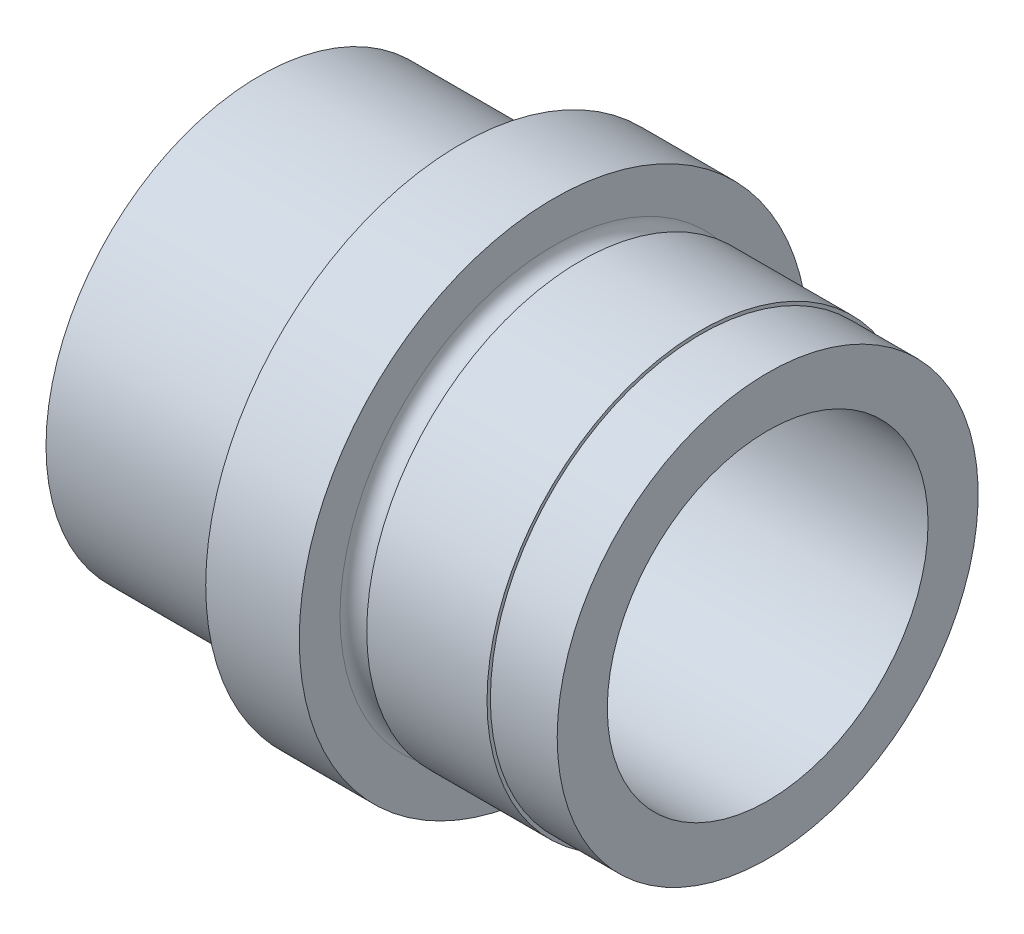
ISO-10303-21;
HEADER;
FILE_DESCRIPTION(('STEP AP214'),'2;1');
FILE_NAME('part.step','',(''),(''),'','','');
FILE_SCHEMA(('AUTOMOTIVE_DESIGN { 1 0 10303 214 1 1 1 1 }'));
ENDSEC;
DATA;
#1=APPLICATION_CONTEXT('core data for automotive mechanical design processes');
#2=APPLICATION_PROTOCOL_DEFINITION('international standard','automotive_design',2000,#1);
#3=PRODUCT_CONTEXT('',#1,'mechanical');
#4=PRODUCT('Part','Part','',(#3));
#5=PRODUCT_RELATED_PRODUCT_CATEGORY('part','',(#4));
#6=PRODUCT_DEFINITION_FORMATION('','',#4);
#7=PRODUCT_DEFINITION_CONTEXT('part definition',#1,'design');
#8=PRODUCT_DEFINITION('design','',#6,#7);
#9=PRODUCT_DEFINITION_SHAPE('','',#8);
#10=(LENGTH_UNIT() NAMED_UNIT(*) SI_UNIT(.MILLI.,.METRE.));
#11=(NAMED_UNIT(*) PLANE_ANGLE_UNIT() SI_UNIT($,.RADIAN.));
#12=(NAMED_UNIT(*) SI_UNIT($,.STERADIAN.) SOLID_ANGLE_UNIT());
#13=UNCERTAINTY_MEASURE_WITH_UNIT(LENGTH_MEASURE(1.E-05),#10,'distance_accuracy_value','');
#14=(GEOMETRIC_REPRESENTATION_CONTEXT(3) GLOBAL_UNCERTAINTY_ASSIGNED_CONTEXT((#13)) GLOBAL_UNIT_ASSIGNED_CONTEXT((#10,
#11,#12)) REPRESENTATION_CONTEXT('',''));
#15=CARTESIAN_POINT('',(0.,0.,0.));
#16=DIRECTION('',(0.,0.,1.));
#17=DIRECTION('',(1.,0.,0.));
#18=AXIS2_PLACEMENT_3D('',#15,#16,#17);
#19=CARTESIAN_POINT('',(-90.6162162162162,0.,0.));
#20=DIRECTION('',(-1.,0.,0.));
#21=DIRECTION('',(0.,0.,1.));
#22=AXIS2_PLACEMENT_3D('',#19,#20,#21);
#23=CYLINDRICAL_SURFACE('',#22,12.25);
#24=CARTESIAN_POINT('',(5.,0.,0.));
#25=DIRECTION('',(-1.,0.,0.));
#26=DIRECTION('',(0.,0.,1.));
#27=AXIS2_PLACEMENT_3D('',#24,#25,#26);
#28=CIRCLE('',#27,12.25);
#29=CARTESIAN_POINT('',(5.,0.,12.25));
#30=VERTEX_POINT('',#29);
#31=EDGE_CURVE('E10',#30,#30,#28,.T.);
#32=ORIENTED_EDGE('',*,*,#31,.F.);
#33=EDGE_LOOP('',(#32));
#34=FACE_BOUND('',#33,.T.);
#35=CARTESIAN_POINT('',(0.,0.,0.));
#36=DIRECTION('',(-1.,0.,0.));
#37=DIRECTION('',(0.,0.,1.));
#38=AXIS2_PLACEMENT_3D('',#35,#36,#37);
#39=CIRCLE('',#38,12.25);
#40=CARTESIAN_POINT('',(0.,0.,12.25));
#41=VERTEX_POINT('',#40);
#42=EDGE_CURVE('E74',#41,#41,#39,.T.);
#43=ORIENTED_EDGE('',*,*,#42,.T.);
#44=EDGE_LOOP('',(#43));
#45=FACE_BOUND('',#44,.T.);
#46=ADVANCED_FACE('F28',(#34,#45),#23,.F.);
#47=CARTESIAN_POINT('',(5.,12.,0.));
#48=DIRECTION('',(1.,0.,0.));
#49=DIRECTION('',(0.,0.,-1.));
#50=AXIS2_PLACEMENT_3D('',#47,#48,#49);
#51=PLANE('',#50);
#52=CARTESIAN_POINT('',(5.,0.,0.));
#53=DIRECTION('',(-1.,0.,0.));
#54=DIRECTION('',(0.,0.,1.));
#55=AXIS2_PLACEMENT_3D('',#52,#53,#54);
#56=CIRCLE('',#55,12.);
#57=CARTESIAN_POINT('',(5.,0.,12.));
#58=VERTEX_POINT('',#57);
#59=EDGE_CURVE('E34',#58,#58,#56,.T.);
#60=ORIENTED_EDGE('',*,*,#59,.F.);
#61=EDGE_LOOP('',(#60));
#62=FACE_BOUND('',#61,.T.);
#63=ORIENTED_EDGE('',*,*,#31,.T.);
#64=EDGE_LOOP('',(#63));
#65=FACE_BOUND('',#64,.T.);
#66=ADVANCED_FACE('F147',(#62,#65),#51,.F.);
#67=CARTESIAN_POINT('',(-90.6162162162162,0.,0.));
#68=DIRECTION('',(-1.,0.,0.));
#69=DIRECTION('',(0.,0.,1.));
#70=AXIS2_PLACEMENT_3D('',#67,#68,#69);
#71=CYLINDRICAL_SURFACE('',#70,12.);
#72=CARTESIAN_POINT('',(38.,0.,0.));
#73=DIRECTION('',(-1.,0.,0.));
#74=DIRECTION('',(0.,0.,1.));
#75=AXIS2_PLACEMENT_3D('',#72,#73,#74);
#76=CIRCLE('',#75,12.);
#77=CARTESIAN_POINT('',(38.,0.,12.));
#78=VERTEX_POINT('',#77);
#79=EDGE_CURVE('E38',#78,#78,#76,.T.);
#80=ORIENTED_EDGE('',*,*,#79,.F.);
#81=EDGE_LOOP('',(#80));
#82=FACE_BOUND('',#81,.T.);
#83=ORIENTED_EDGE('',*,*,#59,.T.);
#84=EDGE_LOOP('',(#83));
#85=FACE_BOUND('',#84,.T.);
#86=ADVANCED_FACE('F142',(#82,#85),#71,.F.);
#87=CARTESIAN_POINT('',(38.,15.75,0.));
#88=DIRECTION('',(-1.,0.,0.));
#89=DIRECTION('',(0.,0.,1.));
#90=AXIS2_PLACEMENT_3D('',#87,#88,#89);
#91=PLANE('',#90);
#92=CARTESIAN_POINT('',(38.,0.,0.));
#93=DIRECTION('',(-1.,0.,0.));
#94=DIRECTION('',(0.,0.,1.));
#95=AXIS2_PLACEMENT_3D('',#92,#93,#94);
#96=CIRCLE('',#95,15.75);
#97=CARTESIAN_POINT('',(38.,0.,15.75));
#98=VERTEX_POINT('',#97);
#99=EDGE_CURVE('E42',#98,#98,#96,.T.);
#100=ORIENTED_EDGE('',*,*,#99,.F.);
#101=EDGE_LOOP('',(#100));
#102=FACE_BOUND('',#101,.T.);
#103=ORIENTED_EDGE('',*,*,#79,.T.);
#104=EDGE_LOOP('',(#103));
#105=FACE_BOUND('',#104,.T.);
#106=ADVANCED_FACE('F136',(#102,#105),#91,.F.);
#107=CARTESIAN_POINT('',(-90.6162162162162,0.,0.));
#108=DIRECTION('',(-1.,0.,0.));
#109=DIRECTION('',(0.,0.,1.));
#110=AXIS2_PLACEMENT_3D('',#107,#108,#109);
#111=CYLINDRICAL_SURFACE('',#110,15.75);
#112=CARTESIAN_POINT('',(33.,0.,0.));
#113=DIRECTION('',(-1.,0.,0.));
#114=DIRECTION('',(0.,0.,1.));
#115=AXIS2_PLACEMENT_3D('',#112,#113,#114);
#116=CIRCLE('',#115,15.75);
#117=CARTESIAN_POINT('',(33.,0.,15.75));
#118=VERTEX_POINT('',#117);
#119=EDGE_CURVE('E47',#118,#118,#116,.T.);
#120=ORIENTED_EDGE('',*,*,#119,.F.);
#121=EDGE_LOOP('',(#120));
#122=FACE_BOUND('',#121,.T.);
#123=ORIENTED_EDGE('',*,*,#99,.T.);
#124=EDGE_LOOP('',(#123));
#125=FACE_BOUND('',#124,.T.);
#126=ADVANCED_FACE('F130',(#122,#125),#111,.T.);
#127=CARTESIAN_POINT('',(33.,16.,0.));
#128=DIRECTION('',(-1.,0.,0.));
#129=DIRECTION('',(0.,0.,1.));
#130=AXIS2_PLACEMENT_3D('',#127,#128,#129);
#131=PLANE('',#130);
#132=CARTESIAN_POINT('',(33.,0.,0.));
#133=DIRECTION('',(-1.,0.,0.));
#134=DIRECTION('',(0.,0.,1.));
#135=AXIS2_PLACEMENT_3D('',#132,#133,#134);
#136=CIRCLE('',#135,16.);
#137=CARTESIAN_POINT('',(33.,0.,16.));
#138=VERTEX_POINT('',#137);
#139=EDGE_CURVE('E50',#138,#138,#136,.T.);
#140=ORIENTED_EDGE('',*,*,#139,.F.);
#141=EDGE_LOOP('',(#140));
#142=FACE_BOUND('',#141,.T.);
#143=ORIENTED_EDGE('',*,*,#119,.T.);
#144=EDGE_LOOP('',(#143));
#145=FACE_BOUND('',#144,.T.);
#146=ADVANCED_FACE('F124',(#142,#145),#131,.F.);
#147=CARTESIAN_POINT('',(-90.6162162162162,0.,0.));
#148=DIRECTION('',(-1.,0.,0.));
#149=DIRECTION('',(0.,0.,1.));
#150=AXIS2_PLACEMENT_3D('',#147,#148,#149);
#151=CYLINDRICAL_SURFACE('',#150,16.);
#152=CARTESIAN_POINT('',(24.,0.,0.));
#153=DIRECTION('',(-1.,0.,0.));
#154=DIRECTION('',(0.,0.,1.));
#155=AXIS2_PLACEMENT_3D('',#152,#153,#154);
#156=CIRCLE('',#155,16.);
#157=CARTESIAN_POINT('',(24.,0.,16.));
#158=VERTEX_POINT('',#157);
#159=EDGE_CURVE('E53',#158,#158,#156,.T.);
#160=ORIENTED_EDGE('',*,*,#159,.F.);
#161=EDGE_LOOP('',(#160));
#162=FACE_BOUND('',#161,.T.);
#163=ORIENTED_EDGE('',*,*,#139,.T.);
#164=EDGE_LOOP('',(#163));
#165=FACE_BOUND('',#164,.T.);
#166=ADVANCED_FACE('F118',(#162,#165),#151,.T.);
#167=CARTESIAN_POINT('',(23.,0.,0.));
#168=DIRECTION('',(-1.,0.,0.));
#169=DIRECTION('',(0.,0.,1.));
#170=AXIS2_PLACEMENT_3D('',#167,#168,#169);
#171=TOROIDAL_SURFACE('',#170,16.,0.999999999999999);
#172=CARTESIAN_POINT('',(22.,0.,0.));
#173=DIRECTION('',(-1.,0.,0.));
#174=DIRECTION('',(0.,0.,1.));
#175=AXIS2_PLACEMENT_3D('',#172,#173,#174);
#176=CIRCLE('',#175,16.);
#177=CARTESIAN_POINT('',(22.,0.,16.));
#178=VERTEX_POINT('',#177);
#179=EDGE_CURVE('E56',#178,#178,#176,.T.);
#180=ORIENTED_EDGE('',*,*,#179,.F.);
#181=EDGE_LOOP('',(#180));
#182=FACE_BOUND('',#181,.T.);
#183=ORIENTED_EDGE('',*,*,#159,.T.);
#184=EDGE_LOOP('',(#183));
#185=FACE_BOUND('',#184,.T.);
#186=ADVANCED_FACE('F112',(#182,#185),#171,.F.);
#187=CARTESIAN_POINT('',(22.,19.05,0.));
#188=DIRECTION('',(-1.,0.,0.));
#189=DIRECTION('',(0.,0.,1.));
#190=AXIS2_PLACEMENT_3D('',#187,#188,#189);
#191=PLANE('',#190);
#192=CARTESIAN_POINT('',(22.,0.,0.));
#193=DIRECTION('',(-1.,0.,0.));
#194=DIRECTION('',(0.,0.,1.));
#195=AXIS2_PLACEMENT_3D('',#192,#193,#194);
#196=CIRCLE('',#195,19.05);
#197=CARTESIAN_POINT('',(22.,0.,19.05));
#198=VERTEX_POINT('',#197);
#199=EDGE_CURVE('E59',#198,#198,#196,.T.);
#200=ORIENTED_EDGE('',*,*,#199,.F.);
#201=EDGE_LOOP('',(#200));
#202=FACE_BOUND('',#201,.T.);
#203=ORIENTED_EDGE('',*,*,#179,.T.);
#204=EDGE_LOOP('',(#203));
#205=FACE_BOUND('',#204,.T.);
#206=ADVANCED_FACE('F106',(#202,#205),#191,.F.);
#207=CARTESIAN_POINT('',(-90.6162162162162,0.,0.));
#208=DIRECTION('',(-1.,0.,0.));
#209=DIRECTION('',(0.,0.,1.));
#210=AXIS2_PLACEMENT_3D('',#207,#208,#209);
#211=CYLINDRICAL_SURFACE('',#210,19.05);
#212=CARTESIAN_POINT('',(15.,0.,0.));
#213=DIRECTION('',(-1.,0.,0.));
#214=DIRECTION('',(0.,0.,1.));
#215=AXIS2_PLACEMENT_3D('',#212,#213,#214);
#216=CIRCLE('',#215,19.05);
#217=CARTESIAN_POINT('',(15.,0.,19.05));
#218=VERTEX_POINT('',#217);
#219=EDGE_CURVE('E62',#218,#218,#216,.T.);
#220=ORIENTED_EDGE('',*,*,#219,.F.);
#221=EDGE_LOOP('',(#220));
#222=FACE_BOUND('',#221,.T.);
#223=ORIENTED_EDGE('',*,*,#199,.T.);
#224=EDGE_LOOP('',(#223));
#225=FACE_BOUND('',#224,.T.);
#226=ADVANCED_FACE('F100',(#222,#225),#211,.T.);
#227=CARTESIAN_POINT('',(15.,16.,0.));
#228=DIRECTION('',(1.,0.,0.));
#229=DIRECTION('',(0.,0.,-1.));
#230=AXIS2_PLACEMENT_3D('',#227,#228,#229);
#231=PLANE('',#230);
#232=CARTESIAN_POINT('',(15.,0.,0.));
#233=DIRECTION('',(-1.,0.,0.));
#234=DIRECTION('',(0.,0.,1.));
#235=AXIS2_PLACEMENT_3D('',#232,#233,#234);
#236=CIRCLE('',#235,16.);
#237=CARTESIAN_POINT('',(15.,0.,16.));
#238=VERTEX_POINT('',#237);
#239=EDGE_CURVE('E65',#238,#238,#236,.T.);
#240=ORIENTED_EDGE('',*,*,#239,.F.);
#241=EDGE_LOOP('',(#240));
#242=FACE_BOUND('',#241,.T.);
#243=ORIENTED_EDGE('',*,*,#219,.T.);
#244=EDGE_LOOP('',(#243));
#245=FACE_BOUND('',#244,.T.);
#246=ADVANCED_FACE('F94',(#242,#245),#231,.F.);
#247=CARTESIAN_POINT('',(14.,0.,0.));
#248=DIRECTION('',(-1.,0.,0.));
#249=DIRECTION('',(0.,0.,1.));
#250=AXIS2_PLACEMENT_3D('',#247,#248,#249);
#251=TOROIDAL_SURFACE('',#250,16.,1.);
#252=CARTESIAN_POINT('',(13.,0.,0.));
#253=DIRECTION('',(-1.,0.,0.));
#254=DIRECTION('',(0.,0.,1.));
#255=AXIS2_PLACEMENT_3D('',#252,#253,#254);
#256=CIRCLE('',#255,16.);
#257=CARTESIAN_POINT('',(13.,0.,16.));
#258=VERTEX_POINT('',#257);
#259=EDGE_CURVE('E68',#258,#258,#256,.T.);
#260=ORIENTED_EDGE('',*,*,#259,.F.);
#261=EDGE_LOOP('',(#260));
#262=FACE_BOUND('',#261,.T.);
#263=ORIENTED_EDGE('',*,*,#239,.T.);
#264=EDGE_LOOP('',(#263));
#265=FACE_BOUND('',#264,.T.);
#266=ADVANCED_FACE('F88',(#262,#265),#251,.F.);
#267=CARTESIAN_POINT('',(-90.6162162162162,0.,0.));
#268=DIRECTION('',(-1.,0.,0.));
#269=DIRECTION('',(0.,0.,1.));
#270=AXIS2_PLACEMENT_3D('',#267,#268,#269);
#271=CYLINDRICAL_SURFACE('',#270,16.);
#272=CARTESIAN_POINT('',(0.,0.,0.));
#273=DIRECTION('',(-1.,0.,0.));
#274=DIRECTION('',(0.,0.,1.));
#275=AXIS2_PLACEMENT_3D('',#272,#273,#274);
#276=CIRCLE('',#275,16.);
#277=CARTESIAN_POINT('',(0.,0.,16.));
#278=VERTEX_POINT('',#277);
#279=EDGE_CURVE('E71',#278,#278,#276,.T.);
#280=ORIENTED_EDGE('',*,*,#279,.F.);
#281=EDGE_LOOP('',(#280));
#282=FACE_BOUND('',#281,.T.);
#283=ORIENTED_EDGE('',*,*,#259,.T.);
#284=EDGE_LOOP('',(#283));
#285=FACE_BOUND('',#284,.T.);
#286=ADVANCED_FACE('F82',(#282,#285),#271,.T.);
#287=CARTESIAN_POINT('',(0.,12.25,0.));
#288=DIRECTION('',(1.,0.,0.));
#289=DIRECTION('',(0.,0.,-1.));
#290=AXIS2_PLACEMENT_3D('',#287,#288,#289);
#291=PLANE('',#290);
#292=ORIENTED_EDGE('',*,*,#42,.F.);
#293=EDGE_LOOP('',(#292));
#294=FACE_BOUND('',#293,.T.);
#295=ORIENTED_EDGE('',*,*,#279,.T.);
#296=EDGE_LOOP('',(#295));
#297=FACE_BOUND('',#296,.T.);
#298=ADVANCED_FACE('F79',(#294,#297),#291,.F.);
#299=CLOSED_SHELL('',(#46,#66,#86,#106,#126,#146,#166,#186,#206,#226,#246,#266,#286,#298));
#300=MANIFOLD_SOLID_BREP('B2',#299);
#301=ADVANCED_BREP_SHAPE_REPRESENTATION('',(#18,#300),#14);
#302=SHAPE_DEFINITION_REPRESENTATION(#9,#301);
ENDSEC;
END-ISO-10303-21;
